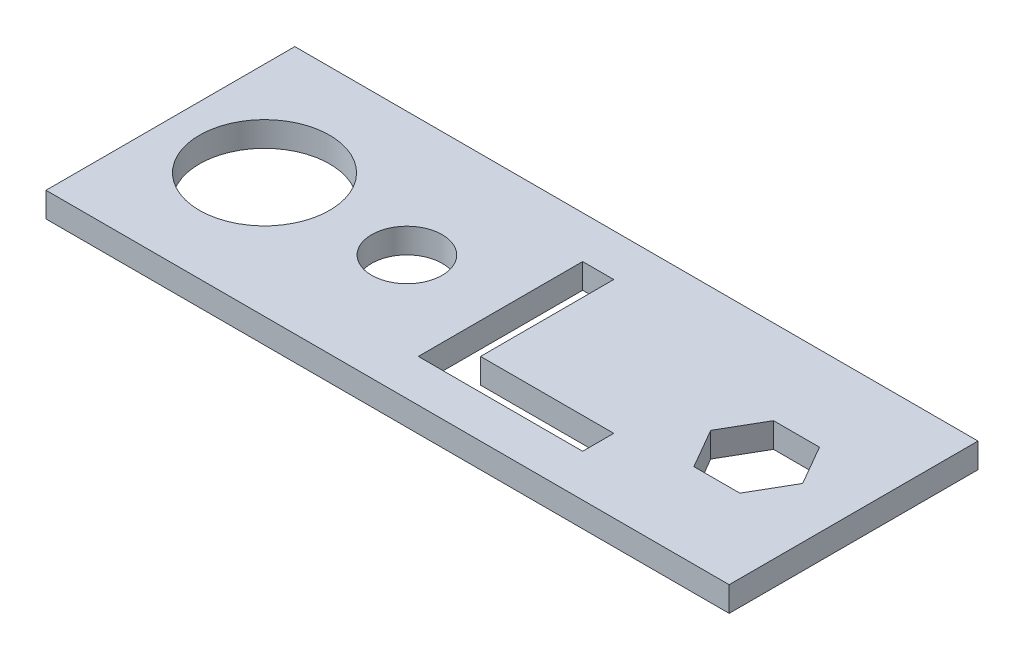
ISO-10303-21;
HEADER;
FILE_DESCRIPTION(('STEP AP214'),'2;1');
FILE_NAME('part.step','',(''),(''),'','','');
FILE_SCHEMA(('AUTOMOTIVE_DESIGN { 1 0 10303 214 1 1 1 1 }'));
ENDSEC;
DATA;
#1=APPLICATION_CONTEXT('core data for automotive mechanical design processes');
#2=APPLICATION_PROTOCOL_DEFINITION('international standard','automotive_design',2000,#1);
#3=PRODUCT_CONTEXT('',#1,'mechanical');
#4=PRODUCT('Part','Part','',(#3));
#5=PRODUCT_RELATED_PRODUCT_CATEGORY('part','',(#4));
#6=PRODUCT_DEFINITION_FORMATION('','',#4);
#7=PRODUCT_DEFINITION_CONTEXT('part definition',#1,'design');
#8=PRODUCT_DEFINITION('design','',#6,#7);
#9=PRODUCT_DEFINITION_SHAPE('','',#8);
#10=(LENGTH_UNIT() NAMED_UNIT(*) SI_UNIT(.MILLI.,.METRE.));
#11=(NAMED_UNIT(*) PLANE_ANGLE_UNIT() SI_UNIT($,.RADIAN.));
#12=(NAMED_UNIT(*) SI_UNIT($,.STERADIAN.) SOLID_ANGLE_UNIT());
#13=UNCERTAINTY_MEASURE_WITH_UNIT(LENGTH_MEASURE(1.E-05),#10,'distance_accuracy_value','');
#14=(GEOMETRIC_REPRESENTATION_CONTEXT(3) GLOBAL_UNCERTAINTY_ASSIGNED_CONTEXT((#13)) GLOBAL_UNIT_ASSIGNED_CONTEXT((#10,
#11,#12)) REPRESENTATION_CONTEXT('',''));
#15=CARTESIAN_POINT('',(0.,0.,0.));
#16=DIRECTION('',(0.,0.,1.));
#17=DIRECTION('',(1.,0.,0.));
#18=AXIS2_PLACEMENT_3D('',#15,#16,#17);
#19=CARTESIAN_POINT('',(0.,3.,0.));
#20=DIRECTION('',(0.,-1.,0.));
#21=DIRECTION('',(0.,0.,-1.));
#22=AXIS2_PLACEMENT_3D('',#19,#20,#21);
#23=PLANE('',#22);
#24=CARTESIAN_POINT('',(28.5118425138933,3.,-15.));
#25=DIRECTION('',(0.,1.,0.));
#26=DIRECTION('',(0.,0.,1.));
#27=AXIS2_PLACEMENT_3D('',#24,#25,#26);
#28=CIRCLE('',#27,4.25);
#29=CARTESIAN_POINT('',(28.5118425138933,3.,-10.75));
#30=VERTEX_POINT('',#29);
#31=EDGE_CURVE('E197',#30,#30,#28,.T.);
#32=ORIENTED_EDGE('',*,*,#31,.F.);
#33=EDGE_LOOP('',(#32));
#34=FACE_BOUND('',#33,.T.);
#35=DIRECTION('',(-1.,0.,0.));
#36=VECTOR('',#35,1.);
#37=CARTESIAN_POINT('',(43.5438494980674,3.,-24.905));
#38=LINE('',#37,#36);
#39=CARTESIAN_POINT('',(43.5438494980674,3.,-24.905));
#40=VERTEX_POINT('',#39);
#41=CARTESIAN_POINT('',(39.7938494980674,3.,-24.905));
#42=VERTEX_POINT('',#41);
#43=EDGE_CURVE('E203',#40,#42,#38,.T.);
#44=ORIENTED_EDGE('',*,*,#43,.F.);
#45=DIRECTION('',(0.,0.,-1.));
#46=VECTOR('',#45,1.);
#47=CARTESIAN_POINT('',(43.5438494980674,3.,-8.845));
#48=LINE('',#47,#46);
#49=CARTESIAN_POINT('',(43.5438494980674,3.,-8.845));
#50=VERTEX_POINT('',#49);
#51=EDGE_CURVE('E215',#50,#40,#48,.T.);
#52=ORIENTED_EDGE('',*,*,#51,.F.);
#53=DIRECTION('',(-1.,0.,0.));
#54=VECTOR('',#53,1.);
#55=CARTESIAN_POINT('',(59.6038494980674,3.,-8.845));
#56=LINE('',#55,#54);
#57=CARTESIAN_POINT('',(59.6038494980674,3.,-8.845));
#58=VERTEX_POINT('',#57);
#59=EDGE_CURVE('E212',#58,#50,#56,.T.);
#60=ORIENTED_EDGE('',*,*,#59,.F.);
#61=DIRECTION('',(0.,0.,-1.));
#62=VECTOR('',#61,1.);
#63=CARTESIAN_POINT('',(59.6038494980674,3.,-5.095));
#64=LINE('',#63,#62);
#65=CARTESIAN_POINT('',(59.6038494980674,3.,-5.095));
#66=VERTEX_POINT('',#65);
#67=EDGE_CURVE('E210',#66,#58,#64,.T.);
#68=ORIENTED_EDGE('',*,*,#67,.F.);
#69=DIRECTION('',(1.,0.,0.));
#70=VECTOR('',#69,1.);
#71=CARTESIAN_POINT('',(39.7938494980674,3.,-5.095));
#72=LINE('',#71,#70);
#73=CARTESIAN_POINT('',(39.7938494980674,3.,-5.095));
#74=VERTEX_POINT('',#73);
#75=EDGE_CURVE('E208',#74,#66,#72,.T.);
#76=ORIENTED_EDGE('',*,*,#75,.F.);
#77=DIRECTION('',(0.,0.,1.));
#78=VECTOR('',#77,1.);
#79=CARTESIAN_POINT('',(39.7938494980674,3.,-24.905));
#80=LINE('',#79,#78);
#81=EDGE_CURVE('E205',#42,#74,#80,.T.);
#82=ORIENTED_EDGE('',*,*,#81,.F.);
#83=EDGE_LOOP('',(#44,#52,#60,#68,#76,#82));
#84=FACE_BOUND('',#83,.T.);
#85=DIRECTION('',(0.,0.,1.));
#86=VECTOR('',#85,1.);
#87=CARTESIAN_POINT('',(0.,3.,0.));
#88=LINE('',#87,#86);
#89=CARTESIAN_POINT('',(0.,3.,-30.));
#90=VERTEX_POINT('',#89);
#91=CARTESIAN_POINT('',(0.,3.,0.));
#92=VERTEX_POINT('',#91);
#93=EDGE_CURVE('E254',#90,#92,#88,.T.);
#94=ORIENTED_EDGE('',*,*,#93,.T.);
#95=DIRECTION('',(1.,0.,0.));
#96=VECTOR('',#95,1.);
#97=CARTESIAN_POINT('',(0.,3.,0.));
#98=LINE('',#97,#96);
#99=CARTESIAN_POINT('',(82.3632909132002,3.,0.));
#100=VERTEX_POINT('',#99);
#101=EDGE_CURVE('E257',#92,#100,#98,.T.);
#102=ORIENTED_EDGE('',*,*,#101,.T.);
#103=DIRECTION('',(0.,0.,-1.));
#104=VECTOR('',#103,1.);
#105=CARTESIAN_POINT('',(82.3632909132002,3.,0.));
#106=LINE('',#105,#104);
#107=CARTESIAN_POINT('',(82.3632909132002,3.,-30.));
#108=VERTEX_POINT('',#107);
#109=EDGE_CURVE('E260',#100,#108,#106,.T.);
#110=ORIENTED_EDGE('',*,*,#109,.T.);
#111=DIRECTION('',(-1.,0.,0.));
#112=VECTOR('',#111,1.);
#113=CARTESIAN_POINT('',(0.,3.,-30.));
#114=LINE('',#113,#112);
#115=EDGE_CURVE('E262',#108,#90,#114,.T.);
#116=ORIENTED_EDGE('',*,*,#115,.T.);
#117=EDGE_LOOP('',(#94,#102,#110,#116));
#118=FACE_BOUND('',#117,.T.);
#119=CARTESIAN_POINT('',(11.3456200564457,3.,-15.));
#120=DIRECTION('',(0.,1.,0.));
#121=DIRECTION('',(0.,0.,1.));
#122=AXIS2_PLACEMENT_3D('',#119,#120,#121);
#123=CIRCLE('',#122,7.85);
#124=CARTESIAN_POINT('',(11.3456200564457,3.,-7.15));
#125=VERTEX_POINT('',#124);
#126=EDGE_CURVE('E248',#125,#125,#123,.T.);
#127=ORIENTED_EDGE('',*,*,#126,.F.);
#128=EDGE_LOOP('',(#127));
#129=FACE_BOUND('',#128,.T.);
#130=DIRECTION('',(-0.499999999999999,0.,-0.866025403784439));
#131=VECTOR('',#130,1.);
#132=CARTESIAN_POINT('',(76.2229798855868,3.,-15.));
#133=LINE('',#132,#131);
#134=CARTESIAN_POINT('',(76.2229798855868,3.,-15.));
#135=VERTEX_POINT('',#134);
#136=CARTESIAN_POINT('',(73.4516985934766,3.,-19.8));
#137=VERTEX_POINT('',#136);
#138=EDGE_CURVE('E146',#135,#137,#133,.T.);
#139=ORIENTED_EDGE('',*,*,#138,.F.);
#140=DIRECTION('',(0.5,0.,-0.866025403784439));
#141=VECTOR('',#140,1.);
#142=CARTESIAN_POINT('',(73.4516985934766,3.,-10.2));
#143=LINE('',#142,#141);
#144=CARTESIAN_POINT('',(73.4516985934766,3.,-10.2));
#145=VERTEX_POINT('',#144);
#146=EDGE_CURVE('E175',#145,#135,#143,.T.);
#147=ORIENTED_EDGE('',*,*,#146,.F.);
#148=DIRECTION('',(1.,0.,0.));
#149=VECTOR('',#148,1.);
#150=CARTESIAN_POINT('',(67.9091360092562,3.,-10.2));
#151=LINE('',#150,#149);
#152=CARTESIAN_POINT('',(67.9091360092562,3.,-10.2));
#153=VERTEX_POINT('',#152);
#154=EDGE_CURVE('E173',#153,#145,#151,.T.);
#155=ORIENTED_EDGE('',*,*,#154,.F.);
#156=DIRECTION('',(0.5,0.,0.866025403784438));
#157=VECTOR('',#156,1.);
#158=CARTESIAN_POINT('',(65.137854717146,3.,-15.));
#159=LINE('',#158,#157);
#160=CARTESIAN_POINT('',(65.137854717146,3.,-15.));
#161=VERTEX_POINT('',#160);
#162=EDGE_CURVE('E169',#161,#153,#159,.T.);
#163=ORIENTED_EDGE('',*,*,#162,.F.);
#164=DIRECTION('',(-0.500000000000001,0.,0.866025403784438));
#165=VECTOR('',#164,1.);
#166=CARTESIAN_POINT('',(67.9091360092562,3.,-19.8));
#167=LINE('',#166,#165);
#168=CARTESIAN_POINT('',(67.9091360092562,3.,-19.8));
#169=VERTEX_POINT('',#168);
#170=EDGE_CURVE('E167',#169,#161,#167,.T.);
#171=ORIENTED_EDGE('',*,*,#170,.F.);
#172=DIRECTION('',(-1.,0.,0.));
#173=VECTOR('',#172,1.);
#174=CARTESIAN_POINT('',(73.4516985934766,3.,-19.8));
#175=LINE('',#174,#173);
#176=EDGE_CURVE('E154',#137,#169,#175,.T.);
#177=ORIENTED_EDGE('',*,*,#176,.F.);
#178=EDGE_LOOP('',(#139,#147,#155,#163,#171,#177));
#179=FACE_BOUND('',#178,.T.);
#180=ADVANCED_FACE('F33',(#34,#84,#118,#129,#179),#23,.F.);
#181=CARTESIAN_POINT('',(0.,0.,0.));
#182=DIRECTION('',(0.,-1.,0.));
#183=DIRECTION('',(0.,0.,-1.));
#184=AXIS2_PLACEMENT_3D('',#181,#182,#183);
#185=PLANE('',#184);
#186=DIRECTION('',(0.,0.,-1.));
#187=VECTOR('',#186,1.);
#188=CARTESIAN_POINT('',(43.5438494980674,0.,-8.845));
#189=LINE('',#188,#187);
#190=CARTESIAN_POINT('',(43.5438494980674,0.,-8.845));
#191=VERTEX_POINT('',#190);
#192=CARTESIAN_POINT('',(43.5438494980674,0.,-24.905));
#193=VERTEX_POINT('',#192);
#194=EDGE_CURVE('E206',#191,#193,#189,.T.);
#195=ORIENTED_EDGE('',*,*,#194,.T.);
#196=DIRECTION('',(-1.,0.,0.));
#197=VECTOR('',#196,1.);
#198=CARTESIAN_POINT('',(43.5438494980674,0.,-24.905));
#199=LINE('',#198,#197);
#200=CARTESIAN_POINT('',(39.7938494980674,0.,-24.905));
#201=VERTEX_POINT('',#200);
#202=EDGE_CURVE('E200',#193,#201,#199,.T.);
#203=ORIENTED_EDGE('',*,*,#202,.T.);
#204=DIRECTION('',(0.,0.,1.));
#205=VECTOR('',#204,1.);
#206=CARTESIAN_POINT('',(39.7938494980674,0.,-24.905));
#207=LINE('',#206,#205);
#208=CARTESIAN_POINT('',(39.7938494980674,0.,-5.095));
#209=VERTEX_POINT('',#208);
#210=EDGE_CURVE('E220',#201,#209,#207,.T.);
#211=ORIENTED_EDGE('',*,*,#210,.T.);
#212=DIRECTION('',(1.,0.,0.));
#213=VECTOR('',#212,1.);
#214=CARTESIAN_POINT('',(39.7938494980674,0.,-5.095));
#215=LINE('',#214,#213);
#216=CARTESIAN_POINT('',(59.6038494980674,0.,-5.095));
#217=VERTEX_POINT('',#216);
#218=EDGE_CURVE('E223',#209,#217,#215,.T.);
#219=ORIENTED_EDGE('',*,*,#218,.T.);
#220=DIRECTION('',(0.,0.,-1.));
#221=VECTOR('',#220,1.);
#222=CARTESIAN_POINT('',(59.6038494980674,0.,-5.095));
#223=LINE('',#222,#221);
#224=CARTESIAN_POINT('',(59.6038494980674,0.,-8.845));
#225=VERTEX_POINT('',#224);
#226=EDGE_CURVE('E226',#217,#225,#223,.T.);
#227=ORIENTED_EDGE('',*,*,#226,.T.);
#228=DIRECTION('',(-1.,0.,0.));
#229=VECTOR('',#228,1.);
#230=CARTESIAN_POINT('',(59.6038494980674,0.,-8.845));
#231=LINE('',#230,#229);
#232=EDGE_CURVE('E229',#225,#191,#231,.T.);
#233=ORIENTED_EDGE('',*,*,#232,.T.);
#234=EDGE_LOOP('',(#195,#203,#211,#219,#227,#233));
#235=FACE_BOUND('',#234,.T.);
#236=CARTESIAN_POINT('',(11.3456200564457,0.,-15.));
#237=DIRECTION('',(0.,1.,0.));
#238=DIRECTION('',(0.,0.,1.));
#239=AXIS2_PLACEMENT_3D('',#236,#237,#238);
#240=CIRCLE('',#239,7.85);
#241=CARTESIAN_POINT('',(11.3456200564457,0.,-7.15));
#242=VERTEX_POINT('',#241);
#243=EDGE_CURVE('E247',#242,#242,#240,.T.);
#244=ORIENTED_EDGE('',*,*,#243,.T.);
#245=EDGE_LOOP('',(#244));
#246=FACE_BOUND('',#245,.T.);
#247=DIRECTION('',(0.,0.,1.));
#248=VECTOR('',#247,1.);
#249=CARTESIAN_POINT('',(0.,0.,0.));
#250=LINE('',#249,#248);
#251=CARTESIAN_POINT('',(0.,0.,-30.));
#252=VERTEX_POINT('',#251);
#253=CARTESIAN_POINT('',(0.,0.,0.));
#254=VERTEX_POINT('',#253);
#255=EDGE_CURVE('E251',#252,#254,#250,.T.);
#256=ORIENTED_EDGE('',*,*,#255,.F.);
#257=DIRECTION('',(-1.,0.,0.));
#258=VECTOR('',#257,1.);
#259=CARTESIAN_POINT('',(0.,0.,-30.));
#260=LINE('',#259,#258);
#261=CARTESIAN_POINT('',(82.3632909132002,0.,-30.));
#262=VERTEX_POINT('',#261);
#263=EDGE_CURVE('E258',#262,#252,#260,.T.);
#264=ORIENTED_EDGE('',*,*,#263,.F.);
#265=DIRECTION('',(0.,0.,-1.));
#266=VECTOR('',#265,1.);
#267=CARTESIAN_POINT('',(82.3632909132002,0.,0.));
#268=LINE('',#267,#266);
#269=CARTESIAN_POINT('',(82.3632909132002,0.,0.));
#270=VERTEX_POINT('',#269);
#271=EDGE_CURVE('E269',#270,#262,#268,.T.);
#272=ORIENTED_EDGE('',*,*,#271,.F.);
#273=DIRECTION('',(1.,0.,0.));
#274=VECTOR('',#273,1.);
#275=CARTESIAN_POINT('',(0.,0.,0.));
#276=LINE('',#275,#274);
#277=EDGE_CURVE('E267',#254,#270,#276,.T.);
#278=ORIENTED_EDGE('',*,*,#277,.F.);
#279=EDGE_LOOP('',(#256,#264,#272,#278));
#280=FACE_BOUND('',#279,.T.);
#281=CARTESIAN_POINT('',(28.5118425138933,0.,-15.));
#282=DIRECTION('',(0.,1.,0.));
#283=DIRECTION('',(0.,0.,1.));
#284=AXIS2_PLACEMENT_3D('',#281,#282,#283);
#285=CIRCLE('',#284,4.25);
#286=CARTESIAN_POINT('',(28.5118425138933,0.,-10.75));
#287=VERTEX_POINT('',#286);
#288=EDGE_CURVE('E162',#287,#287,#285,.T.);
#289=ORIENTED_EDGE('',*,*,#288,.T.);
#290=EDGE_LOOP('',(#289));
#291=FACE_BOUND('',#290,.T.);
#292=DIRECTION('',(0.5,0.,-0.866025403784439));
#293=VECTOR('',#292,1.);
#294=CARTESIAN_POINT('',(73.4516985934766,0.,-10.2));
#295=LINE('',#294,#293);
#296=CARTESIAN_POINT('',(73.4516985934766,0.,-10.2));
#297=VERTEX_POINT('',#296);
#298=CARTESIAN_POINT('',(76.2229798855868,0.,-15.));
#299=VERTEX_POINT('',#298);
#300=EDGE_CURVE('E155',#297,#299,#295,.T.);
#301=ORIENTED_EDGE('',*,*,#300,.T.);
#302=DIRECTION('',(-0.499999999999999,0.,-0.866025403784439));
#303=VECTOR('',#302,1.);
#304=CARTESIAN_POINT('',(76.2229798855868,0.,-15.));
#305=LINE('',#304,#303);
#306=CARTESIAN_POINT('',(73.4516985934766,0.,-19.8));
#307=VERTEX_POINT('',#306);
#308=EDGE_CURVE('E56',#299,#307,#305,.T.);
#309=ORIENTED_EDGE('',*,*,#308,.T.);
#310=DIRECTION('',(-1.,0.,0.));
#311=VECTOR('',#310,1.);
#312=CARTESIAN_POINT('',(73.4516985934766,0.,-19.8));
#313=LINE('',#312,#311);
#314=CARTESIAN_POINT('',(67.9091360092562,0.,-19.8));
#315=VERTEX_POINT('',#314);
#316=EDGE_CURVE('E161',#307,#315,#313,.T.);
#317=ORIENTED_EDGE('',*,*,#316,.T.);
#318=DIRECTION('',(-0.500000000000001,0.,0.866025403784438));
#319=VECTOR('',#318,1.);
#320=CARTESIAN_POINT('',(67.9091360092562,0.,-19.8));
#321=LINE('',#320,#319);
#322=CARTESIAN_POINT('',(65.137854717146,0.,-15.));
#323=VERTEX_POINT('',#322);
#324=EDGE_CURVE('E179',#315,#323,#321,.T.);
#325=ORIENTED_EDGE('',*,*,#324,.T.);
#326=DIRECTION('',(0.5,0.,0.866025403784438));
#327=VECTOR('',#326,1.);
#328=CARTESIAN_POINT('',(65.137854717146,0.,-15.));
#329=LINE('',#328,#327);
#330=CARTESIAN_POINT('',(67.9091360092562,0.,-10.2));
#331=VERTEX_POINT('',#330);
#332=EDGE_CURVE('E182',#323,#331,#329,.T.);
#333=ORIENTED_EDGE('',*,*,#332,.T.);
#334=DIRECTION('',(1.,0.,0.));
#335=VECTOR('',#334,1.);
#336=CARTESIAN_POINT('',(67.9091360092562,0.,-10.2));
#337=LINE('',#336,#335);
#338=EDGE_CURVE('E185',#331,#297,#337,.T.);
#339=ORIENTED_EDGE('',*,*,#338,.T.);
#340=EDGE_LOOP('',(#301,#309,#317,#325,#333,#339));
#341=FACE_BOUND('',#340,.T.);
#342=ADVANCED_FACE('F287',(#235,#246,#280,#291,#341),#185,.T.);
#343=CARTESIAN_POINT('',(0.,3.,0.));
#344=DIRECTION('',(1.,0.,0.));
#345=DIRECTION('',(0.,0.,-1.));
#346=AXIS2_PLACEMENT_3D('',#343,#344,#345);
#347=PLANE('',#346);
#348=ORIENTED_EDGE('',*,*,#255,.T.);
#349=DIRECTION('',(0.,-1.,0.));
#350=VECTOR('',#349,1.);
#351=CARTESIAN_POINT('',(0.,3.,0.));
#352=LINE('',#351,#350);
#353=EDGE_CURVE('E11',#92,#254,#352,.T.);
#354=ORIENTED_EDGE('',*,*,#353,.F.);
#355=ORIENTED_EDGE('',*,*,#93,.F.);
#356=DIRECTION('',(0.,-1.,0.));
#357=VECTOR('',#356,1.);
#358=CARTESIAN_POINT('',(0.,3.,-30.));
#359=LINE('',#358,#357);
#360=EDGE_CURVE('E264',#90,#252,#359,.T.);
#361=ORIENTED_EDGE('',*,*,#360,.T.);
#362=EDGE_LOOP('',(#348,#354,#355,#361));
#363=FACE_BOUND('',#362,.T.);
#364=ADVANCED_FACE('F35',(#363),#347,.F.);
#365=CARTESIAN_POINT('',(0.,3.,0.));
#366=DIRECTION('',(0.,0.,-1.));
#367=DIRECTION('',(-1.,0.,0.));
#368=AXIS2_PLACEMENT_3D('',#365,#366,#367);
#369=PLANE('',#368);
#370=ORIENTED_EDGE('',*,*,#277,.T.);
#371=DIRECTION('',(0.,-1.,0.));
#372=VECTOR('',#371,1.);
#373=CARTESIAN_POINT('',(82.3632909132002,3.,0.));
#374=LINE('',#373,#372);
#375=EDGE_CURVE('E41',#100,#270,#374,.T.);
#376=ORIENTED_EDGE('',*,*,#375,.F.);
#377=ORIENTED_EDGE('',*,*,#101,.F.);
#378=ORIENTED_EDGE('',*,*,#353,.T.);
#379=EDGE_LOOP('',(#370,#376,#377,#378));
#380=FACE_BOUND('',#379,.T.);
#381=ADVANCED_FACE('F298',(#380),#369,.F.);
#382=CARTESIAN_POINT('',(82.3632909132002,3.,0.));
#383=DIRECTION('',(-1.,0.,0.));
#384=DIRECTION('',(0.,0.,1.));
#385=AXIS2_PLACEMENT_3D('',#382,#383,#384);
#386=PLANE('',#385);
#387=ORIENTED_EDGE('',*,*,#271,.T.);
#388=DIRECTION('',(0.,-1.,0.));
#389=VECTOR('',#388,1.);
#390=CARTESIAN_POINT('',(82.3632909132002,3.,-30.));
#391=LINE('',#390,#389);
#392=EDGE_CURVE('E274',#108,#262,#391,.T.);
#393=ORIENTED_EDGE('',*,*,#392,.F.);
#394=ORIENTED_EDGE('',*,*,#109,.F.);
#395=ORIENTED_EDGE('',*,*,#375,.T.);
#396=EDGE_LOOP('',(#387,#393,#394,#395));
#397=FACE_BOUND('',#396,.T.);
#398=ADVANCED_FACE('F281',(#397),#386,.F.);
#399=CARTESIAN_POINT('',(0.,3.,-30.));
#400=DIRECTION('',(0.,0.,1.));
#401=DIRECTION('',(1.,0.,0.));
#402=AXIS2_PLACEMENT_3D('',#399,#400,#401);
#403=PLANE('',#402);
#404=ORIENTED_EDGE('',*,*,#263,.T.);
#405=ORIENTED_EDGE('',*,*,#360,.F.);
#406=ORIENTED_EDGE('',*,*,#115,.F.);
#407=ORIENTED_EDGE('',*,*,#392,.T.);
#408=EDGE_LOOP('',(#404,#405,#406,#407));
#409=FACE_BOUND('',#408,.T.);
#410=ADVANCED_FACE('F291',(#409),#403,.F.);
#411=CARTESIAN_POINT('',(11.3456200564457,3.,-15.));
#412=DIRECTION('',(0.,-1.,0.));
#413=DIRECTION('',(0.,0.,-1.));
#414=AXIS2_PLACEMENT_3D('',#411,#412,#413);
#415=CYLINDRICAL_SURFACE('',#414,7.85);
#416=ORIENTED_EDGE('',*,*,#126,.T.);
#417=EDGE_LOOP('',(#416));
#418=FACE_BOUND('',#417,.T.);
#419=ORIENTED_EDGE('',*,*,#243,.F.);
#420=EDGE_LOOP('',(#419));
#421=FACE_BOUND('',#420,.T.);
#422=ADVANCED_FACE('F316',(#418,#421),#415,.F.);
#423=CARTESIAN_POINT('',(43.5438494980674,3.,-24.905));
#424=DIRECTION('',(0.,0.,1.));
#425=DIRECTION('',(1.,0.,0.));
#426=AXIS2_PLACEMENT_3D('',#423,#424,#425);
#427=PLANE('',#426);
#428=ORIENTED_EDGE('',*,*,#202,.F.);
#429=DIRECTION('',(0.,-1.,0.));
#430=VECTOR('',#429,1.);
#431=CARTESIAN_POINT('',(43.5438494980674,3.,-24.905));
#432=LINE('',#431,#430);
#433=EDGE_CURVE('E217',#40,#193,#432,.T.);
#434=ORIENTED_EDGE('',*,*,#433,.F.);
#435=ORIENTED_EDGE('',*,*,#43,.T.);
#436=DIRECTION('',(0.,-1.,0.));
#437=VECTOR('',#436,1.);
#438=CARTESIAN_POINT('',(39.7938494980674,3.,-24.905));
#439=LINE('',#438,#437);
#440=EDGE_CURVE('E244',#42,#201,#439,.T.);
#441=ORIENTED_EDGE('',*,*,#440,.T.);
#442=EDGE_LOOP('',(#428,#434,#435,#441));
#443=FACE_BOUND('',#442,.T.);
#444=ADVANCED_FACE('F323',(#443),#427,.T.);
#445=CARTESIAN_POINT('',(39.7938494980674,3.,-24.905));
#446=DIRECTION('',(1.,0.,0.));
#447=DIRECTION('',(0.,0.,-1.));
#448=AXIS2_PLACEMENT_3D('',#445,#446,#447);
#449=PLANE('',#448);
#450=ORIENTED_EDGE('',*,*,#210,.F.);
#451=ORIENTED_EDGE('',*,*,#440,.F.);
#452=ORIENTED_EDGE('',*,*,#81,.T.);
#453=DIRECTION('',(0.,-1.,0.));
#454=VECTOR('',#453,1.);
#455=CARTESIAN_POINT('',(39.7938494980674,3.,-5.095));
#456=LINE('',#455,#454);
#457=EDGE_CURVE('E242',#74,#209,#456,.T.);
#458=ORIENTED_EDGE('',*,*,#457,.T.);
#459=EDGE_LOOP('',(#450,#451,#452,#458));
#460=FACE_BOUND('',#459,.T.);
#461=ADVANCED_FACE('F328',(#460),#449,.T.);
#462=CARTESIAN_POINT('',(39.7938494980674,3.,-5.095));
#463=DIRECTION('',(0.,0.,-1.));
#464=DIRECTION('',(-1.,0.,0.));
#465=AXIS2_PLACEMENT_3D('',#462,#463,#464);
#466=PLANE('',#465);
#467=ORIENTED_EDGE('',*,*,#218,.F.);
#468=ORIENTED_EDGE('',*,*,#457,.F.);
#469=ORIENTED_EDGE('',*,*,#75,.T.);
#470=DIRECTION('',(0.,-1.,0.));
#471=VECTOR('',#470,1.);
#472=CARTESIAN_POINT('',(59.6038494980674,3.,-5.095));
#473=LINE('',#472,#471);
#474=EDGE_CURVE('E240',#66,#217,#473,.T.);
#475=ORIENTED_EDGE('',*,*,#474,.T.);
#476=EDGE_LOOP('',(#467,#468,#469,#475));
#477=FACE_BOUND('',#476,.T.);
#478=ADVANCED_FACE('F337',(#477),#466,.T.);
#479=CARTESIAN_POINT('',(59.6038494980674,3.,-5.095));
#480=DIRECTION('',(-1.,0.,0.));
#481=DIRECTION('',(0.,0.,1.));
#482=AXIS2_PLACEMENT_3D('',#479,#480,#481);
#483=PLANE('',#482);
#484=ORIENTED_EDGE('',*,*,#226,.F.);
#485=ORIENTED_EDGE('',*,*,#474,.F.);
#486=ORIENTED_EDGE('',*,*,#67,.T.);
#487=DIRECTION('',(0.,-1.,0.));
#488=VECTOR('',#487,1.);
#489=CARTESIAN_POINT('',(59.6038494980674,3.,-8.845));
#490=LINE('',#489,#488);
#491=EDGE_CURVE('E238',#58,#225,#490,.T.);
#492=ORIENTED_EDGE('',*,*,#491,.T.);
#493=EDGE_LOOP('',(#484,#485,#486,#492));
#494=FACE_BOUND('',#493,.T.);
#495=ADVANCED_FACE('F343',(#494),#483,.T.);
#496=CARTESIAN_POINT('',(59.6038494980674,3.,-8.845));
#497=DIRECTION('',(0.,0.,1.));
#498=DIRECTION('',(1.,0.,0.));
#499=AXIS2_PLACEMENT_3D('',#496,#497,#498);
#500=PLANE('',#499);
#501=ORIENTED_EDGE('',*,*,#232,.F.);
#502=ORIENTED_EDGE('',*,*,#491,.F.);
#503=ORIENTED_EDGE('',*,*,#59,.T.);
#504=DIRECTION('',(0.,-1.,0.));
#505=VECTOR('',#504,1.);
#506=CARTESIAN_POINT('',(43.5438494980674,3.,-8.845));
#507=LINE('',#506,#505);
#508=EDGE_CURVE('E236',#50,#191,#507,.T.);
#509=ORIENTED_EDGE('',*,*,#508,.T.);
#510=EDGE_LOOP('',(#501,#502,#503,#509));
#511=FACE_BOUND('',#510,.T.);
#512=ADVANCED_FACE('F347',(#511),#500,.T.);
#513=CARTESIAN_POINT('',(43.5438494980674,3.,-8.845));
#514=DIRECTION('',(-1.,0.,0.));
#515=DIRECTION('',(0.,0.,1.));
#516=AXIS2_PLACEMENT_3D('',#513,#514,#515);
#517=PLANE('',#516);
#518=ORIENTED_EDGE('',*,*,#194,.F.);
#519=ORIENTED_EDGE('',*,*,#508,.F.);
#520=ORIENTED_EDGE('',*,*,#51,.T.);
#521=ORIENTED_EDGE('',*,*,#433,.T.);
#522=EDGE_LOOP('',(#518,#519,#520,#521));
#523=FACE_BOUND('',#522,.T.);
#524=ADVANCED_FACE('F351',(#523),#517,.T.);
#525=CARTESIAN_POINT('',(28.5118425138933,3.,-15.));
#526=DIRECTION('',(0.,-1.,0.));
#527=DIRECTION('',(0.,0.,-1.));
#528=AXIS2_PLACEMENT_3D('',#525,#526,#527);
#529=CYLINDRICAL_SURFACE('',#528,4.25);
#530=ORIENTED_EDGE('',*,*,#31,.T.);
#531=EDGE_LOOP('',(#530));
#532=FACE_BOUND('',#531,.T.);
#533=ORIENTED_EDGE('',*,*,#288,.F.);
#534=EDGE_LOOP('',(#533));
#535=FACE_BOUND('',#534,.T.);
#536=ADVANCED_FACE('F355',(#532,#535),#529,.F.);
#537=CARTESIAN_POINT('',(76.2229798855868,3.,-15.));
#538=DIRECTION('',(-0.866025403784439,0.,0.499999999999999));
#539=DIRECTION('',(0.499999999999999,0.,0.866025403784439));
#540=AXIS2_PLACEMENT_3D('',#537,#538,#539);
#541=PLANE('',#540);
#542=ORIENTED_EDGE('',*,*,#308,.F.);
#543=DIRECTION('',(0.,-1.,0.));
#544=VECTOR('',#543,1.);
#545=CARTESIAN_POINT('',(76.2229798855868,3.,-15.));
#546=LINE('',#545,#544);
#547=EDGE_CURVE('E150',#135,#299,#546,.T.);
#548=ORIENTED_EDGE('',*,*,#547,.F.);
#549=ORIENTED_EDGE('',*,*,#138,.T.);
#550=DIRECTION('',(0.,-1.,0.));
#551=VECTOR('',#550,1.);
#552=CARTESIAN_POINT('',(73.4516985934766,3.,-19.8));
#553=LINE('',#552,#551);
#554=EDGE_CURVE('E149',#137,#307,#553,.T.);
#555=ORIENTED_EDGE('',*,*,#554,.T.);
#556=EDGE_LOOP('',(#542,#548,#549,#555));
#557=FACE_BOUND('',#556,.T.);
#558=ADVANCED_FACE('F148',(#557),#541,.T.);
#559=CARTESIAN_POINT('',(73.4516985934766,3.,-19.8));
#560=DIRECTION('',(0.,0.,1.));
#561=DIRECTION('',(1.,0.,0.));
#562=AXIS2_PLACEMENT_3D('',#559,#560,#561);
#563=PLANE('',#562);
#564=ORIENTED_EDGE('',*,*,#316,.F.);
#565=ORIENTED_EDGE('',*,*,#554,.F.);
#566=ORIENTED_EDGE('',*,*,#176,.T.);
#567=DIRECTION('',(0.,-1.,0.));
#568=VECTOR('',#567,1.);
#569=CARTESIAN_POINT('',(67.9091360092562,3.,-19.8));
#570=LINE('',#569,#568);
#571=EDGE_CURVE('E163',#169,#315,#570,.T.);
#572=ORIENTED_EDGE('',*,*,#571,.T.);
#573=EDGE_LOOP('',(#564,#565,#566,#572));
#574=FACE_BOUND('',#573,.T.);
#575=ADVANCED_FACE('F158',(#574),#563,.T.);
#576=CARTESIAN_POINT('',(67.9091360092562,3.,-19.8));
#577=DIRECTION('',(0.866025403784438,0.,0.500000000000001));
#578=DIRECTION('',(0.500000000000001,0.,-0.866025403784438));
#579=AXIS2_PLACEMENT_3D('',#576,#577,#578);
#580=PLANE('',#579);
#581=ORIENTED_EDGE('',*,*,#324,.F.);
#582=ORIENTED_EDGE('',*,*,#571,.F.);
#583=ORIENTED_EDGE('',*,*,#170,.T.);
#584=DIRECTION('',(0.,-1.,0.));
#585=VECTOR('',#584,1.);
#586=CARTESIAN_POINT('',(65.137854717146,3.,-15.));
#587=LINE('',#586,#585);
#588=EDGE_CURVE('E194',#161,#323,#587,.T.);
#589=ORIENTED_EDGE('',*,*,#588,.T.);
#590=EDGE_LOOP('',(#581,#582,#583,#589));
#591=FACE_BOUND('',#590,.T.);
#592=ADVANCED_FACE('F364',(#591),#580,.T.);
#593=CARTESIAN_POINT('',(65.137854717146,3.,-15.));
#594=DIRECTION('',(0.866025403784438,0.,-0.5));
#595=DIRECTION('',(-0.5,0.,-0.866025403784438));
#596=AXIS2_PLACEMENT_3D('',#593,#594,#595);
#597=PLANE('',#596);
#598=ORIENTED_EDGE('',*,*,#332,.F.);
#599=ORIENTED_EDGE('',*,*,#588,.F.);
#600=ORIENTED_EDGE('',*,*,#162,.T.);
#601=DIRECTION('',(0.,-1.,0.));
#602=VECTOR('',#601,1.);
#603=CARTESIAN_POINT('',(67.9091360092562,3.,-10.2));
#604=LINE('',#603,#602);
#605=EDGE_CURVE('E192',#153,#331,#604,.T.);
#606=ORIENTED_EDGE('',*,*,#605,.T.);
#607=EDGE_LOOP('',(#598,#599,#600,#606));
#608=FACE_BOUND('',#607,.T.);
#609=ADVANCED_FACE('F367',(#608),#597,.T.);
#610=CARTESIAN_POINT('',(67.9091360092562,3.,-10.2));
#611=DIRECTION('',(0.,0.,-1.));
#612=DIRECTION('',(-1.,0.,0.));
#613=AXIS2_PLACEMENT_3D('',#610,#611,#612);
#614=PLANE('',#613);
#615=ORIENTED_EDGE('',*,*,#338,.F.);
#616=ORIENTED_EDGE('',*,*,#605,.F.);
#617=ORIENTED_EDGE('',*,*,#154,.T.);
#618=DIRECTION('',(0.,-1.,0.));
#619=VECTOR('',#618,1.);
#620=CARTESIAN_POINT('',(73.4516985934766,3.,-10.2));
#621=LINE('',#620,#619);
#622=EDGE_CURVE('E48',#145,#297,#621,.T.);
#623=ORIENTED_EDGE('',*,*,#622,.T.);
#624=EDGE_LOOP('',(#615,#616,#617,#623));
#625=FACE_BOUND('',#624,.T.);
#626=ADVANCED_FACE('F371',(#625),#614,.T.);
#627=CARTESIAN_POINT('',(73.4516985934766,3.,-10.2));
#628=DIRECTION('',(-0.866025403784438,0.,-0.5));
#629=DIRECTION('',(-0.5,0.,0.866025403784439));
#630=AXIS2_PLACEMENT_3D('',#627,#628,#629);
#631=PLANE('',#630);
#632=ORIENTED_EDGE('',*,*,#300,.F.);
#633=ORIENTED_EDGE('',*,*,#622,.F.);
#634=ORIENTED_EDGE('',*,*,#146,.T.);
#635=ORIENTED_EDGE('',*,*,#547,.T.);
#636=EDGE_LOOP('',(#632,#633,#634,#635));
#637=FACE_BOUND('',#636,.T.);
#638=ADVANCED_FACE('F375',(#637),#631,.T.);
#639=CLOSED_SHELL('',(#180,#342,#364,#381,#398,#410,#422,#444,#461,#478,#495,#512,#524,#536,
#558,#575,#592,#609,#626,#638));
#640=MANIFOLD_SOLID_BREP('B2',#639);
#641=ADVANCED_BREP_SHAPE_REPRESENTATION('',(#18,#640),#14);
#642=SHAPE_DEFINITION_REPRESENTATION(#9,#641);
ENDSEC;
END-ISO-10303-21;
